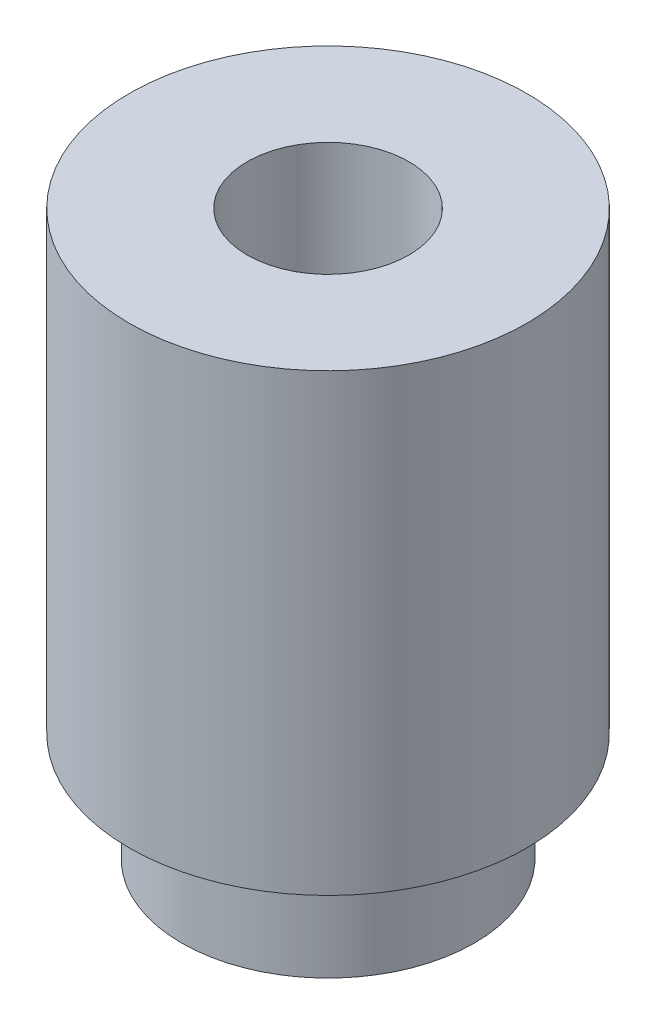
ISO-10303-21;
HEADER;
FILE_DESCRIPTION(('STEP AP214'),'2;1');
FILE_NAME('part.step','',(''),(''),'','','');
FILE_SCHEMA(('AUTOMOTIVE_DESIGN { 1 0 10303 214 1 1 1 1 }'));
ENDSEC;
DATA;
#1=APPLICATION_CONTEXT('core data for automotive mechanical design processes');
#2=APPLICATION_PROTOCOL_DEFINITION('international standard','automotive_design',2000,#1);
#3=PRODUCT_CONTEXT('',#1,'mechanical');
#4=PRODUCT('Part','Part','',(#3));
#5=PRODUCT_RELATED_PRODUCT_CATEGORY('part','',(#4));
#6=PRODUCT_DEFINITION_FORMATION('','',#4);
#7=PRODUCT_DEFINITION_CONTEXT('part definition',#1,'design');
#8=PRODUCT_DEFINITION('design','',#6,#7);
#9=PRODUCT_DEFINITION_SHAPE('','',#8);
#10=(LENGTH_UNIT() NAMED_UNIT(*) SI_UNIT(.MILLI.,.METRE.));
#11=(NAMED_UNIT(*) PLANE_ANGLE_UNIT() SI_UNIT($,.RADIAN.));
#12=(NAMED_UNIT(*) SI_UNIT($,.STERADIAN.) SOLID_ANGLE_UNIT());
#13=UNCERTAINTY_MEASURE_WITH_UNIT(LENGTH_MEASURE(1.E-05),#10,'distance_accuracy_value','');
#14=(GEOMETRIC_REPRESENTATION_CONTEXT(3) GLOBAL_UNCERTAINTY_ASSIGNED_CONTEXT((#13)) GLOBAL_UNIT_ASSIGNED_CONTEXT((#10,
#11,#12)) REPRESENTATION_CONTEXT('',''));
#15=CARTESIAN_POINT('',(0.,0.,0.));
#16=DIRECTION('',(0.,0.,1.));
#17=DIRECTION('',(1.,0.,0.));
#18=AXIS2_PLACEMENT_3D('',#15,#16,#17);
#19=CARTESIAN_POINT('',(0.,1.52,0.));
#20=DIRECTION('',(0.,-1.,0.));
#21=DIRECTION('',(0.,0.,-1.));
#22=AXIS2_PLACEMENT_3D('',#19,#20,#21);
#23=CYLINDRICAL_SURFACE('',#22,2.045);
#24=CARTESIAN_POINT('',(0.,1.52,0.));
#25=DIRECTION('',(0.,1.,0.));
#26=DIRECTION('',(0.,0.,1.));
#27=AXIS2_PLACEMENT_3D('',#24,#25,#26);
#28=CIRCLE('',#27,2.045);
#29=CARTESIAN_POINT('',(0.,1.52,2.045));
#30=VERTEX_POINT('',#29);
#31=EDGE_CURVE('E10',#30,#30,#28,.T.);
#32=ORIENTED_EDGE('',*,*,#31,.F.);
#33=EDGE_LOOP('',(#32));
#34=FACE_BOUND('',#33,.T.);
#35=CARTESIAN_POINT('',(0.,0.,0.));
#36=DIRECTION('',(0.,1.,0.));
#37=DIRECTION('',(0.,0.,1.));
#38=AXIS2_PLACEMENT_3D('',#35,#36,#37);
#39=CIRCLE('',#38,2.045);
#40=CARTESIAN_POINT('',(0.,0.,2.045));
#41=VERTEX_POINT('',#40);
#42=EDGE_CURVE('E45',#41,#41,#39,.T.);
#43=ORIENTED_EDGE('',*,*,#42,.T.);
#44=EDGE_LOOP('',(#43));
#45=FACE_BOUND('',#44,.T.);
#46=ADVANCED_FACE('F42',(#34,#45),#23,.T.);
#47=CARTESIAN_POINT('',(0.,0.,0.));
#48=DIRECTION('',(0.,1.,0.));
#49=DIRECTION('',(0.,0.,1.));
#50=AXIS2_PLACEMENT_3D('',#47,#48,#49);
#51=PLANE('',#50);
#52=CARTESIAN_POINT('',(0.,0.,0.));
#53=DIRECTION('',(0.,1.,0.));
#54=DIRECTION('',(0.,0.,1.));
#55=AXIS2_PLACEMENT_3D('',#52,#53,#54);
#56=CIRCLE('',#55,1.1303);
#57=CARTESIAN_POINT('',(0.,0.,1.1303));
#58=VERTEX_POINT('',#57);
#59=EDGE_CURVE('E60',#58,#58,#56,.T.);
#60=ORIENTED_EDGE('',*,*,#59,.T.);
#61=EDGE_LOOP('',(#60));
#62=FACE_BOUND('',#61,.T.);
#63=ORIENTED_EDGE('',*,*,#42,.F.);
#64=EDGE_LOOP('',(#63));
#65=FACE_BOUND('',#64,.T.);
#66=ADVANCED_FACE('F84',(#62,#65),#51,.F.);
#67=CARTESIAN_POINT('',(0.,7.87,0.));
#68=DIRECTION('',(0.,-1.,0.));
#69=DIRECTION('',(0.,0.,-1.));
#70=AXIS2_PLACEMENT_3D('',#67,#68,#69);
#71=CYLINDRICAL_SURFACE('',#70,2.78);
#72=CARTESIAN_POINT('',(0.,7.87,0.));
#73=DIRECTION('',(0.,1.,0.));
#74=DIRECTION('',(0.,0.,1.));
#75=AXIS2_PLACEMENT_3D('',#72,#73,#74);
#76=CIRCLE('',#75,2.78);
#77=CARTESIAN_POINT('',(0.,7.87,2.78));
#78=VERTEX_POINT('',#77);
#79=EDGE_CURVE('E54',#78,#78,#76,.T.);
#80=ORIENTED_EDGE('',*,*,#79,.F.);
#81=EDGE_LOOP('',(#80));
#82=FACE_BOUND('',#81,.T.);
#83=CARTESIAN_POINT('',(0.,1.52,0.));
#84=DIRECTION('',(0.,1.,0.));
#85=DIRECTION('',(0.,0.,1.));
#86=AXIS2_PLACEMENT_3D('',#83,#84,#85);
#87=CIRCLE('',#86,2.78);
#88=CARTESIAN_POINT('',(0.,1.52,2.78));
#89=VERTEX_POINT('',#88);
#90=EDGE_CURVE('E56',#89,#89,#87,.T.);
#91=ORIENTED_EDGE('',*,*,#90,.T.);
#92=EDGE_LOOP('',(#91));
#93=FACE_BOUND('',#92,.T.);
#94=ADVANCED_FACE('F78',(#82,#93),#71,.T.);
#95=CARTESIAN_POINT('',(0.,7.87,0.));
#96=DIRECTION('',(0.,1.,0.));
#97=DIRECTION('',(0.,0.,1.));
#98=AXIS2_PLACEMENT_3D('',#95,#96,#97);
#99=PLANE('',#98);
#100=CARTESIAN_POINT('',(0.,7.87,0.));
#101=DIRECTION('',(0.,1.,0.));
#102=DIRECTION('',(0.,0.,1.));
#103=AXIS2_PLACEMENT_3D('',#100,#101,#102);
#104=CIRCLE('',#103,1.1303);
#105=CARTESIAN_POINT('',(0.,7.87,1.1303));
#106=VERTEX_POINT('',#105);
#107=EDGE_CURVE('E67',#106,#106,#104,.T.);
#108=ORIENTED_EDGE('',*,*,#107,.F.);
#109=EDGE_LOOP('',(#108));
#110=FACE_BOUND('',#109,.T.);
#111=ORIENTED_EDGE('',*,*,#79,.T.);
#112=EDGE_LOOP('',(#111));
#113=FACE_BOUND('',#112,.T.);
#114=ADVANCED_FACE('F74',(#110,#113),#99,.T.);
#115=CARTESIAN_POINT('',(0.,1.52,0.));
#116=DIRECTION('',(0.,1.,0.));
#117=DIRECTION('',(0.,0.,1.));
#118=AXIS2_PLACEMENT_3D('',#115,#116,#117);
#119=PLANE('',#118);
#120=ORIENTED_EDGE('',*,*,#31,.T.);
#121=EDGE_LOOP('',(#120));
#122=FACE_BOUND('',#121,.T.);
#123=ORIENTED_EDGE('',*,*,#90,.F.);
#124=EDGE_LOOP('',(#123));
#125=FACE_BOUND('',#124,.T.);
#126=ADVANCED_FACE('F77',(#122,#125),#119,.F.);
#127=CARTESIAN_POINT('',(0.,7.87,0.));
#128=DIRECTION('',(0.,1.,0.));
#129=DIRECTION('',(0.,0.,1.));
#130=AXIS2_PLACEMENT_3D('',#127,#128,#129);
#131=CYLINDRICAL_SURFACE('',#130,1.1303);
#132=ORIENTED_EDGE('',*,*,#59,.F.);
#133=EDGE_LOOP('',(#132));
#134=FACE_BOUND('',#133,.T.);
#135=ORIENTED_EDGE('',*,*,#107,.T.);
#136=EDGE_LOOP('',(#135));
#137=FACE_BOUND('',#136,.T.);
#138=ADVANCED_FACE('F72',(#134,#137),#131,.F.);
#139=CLOSED_SHELL('',(#46,#66,#94,#114,#126,#138));
#140=MANIFOLD_SOLID_BREP('B2',#139);
#141=ADVANCED_BREP_SHAPE_REPRESENTATION('',(#18,#140),#14);
#142=SHAPE_DEFINITION_REPRESENTATION(#9,#141);
ENDSEC;
END-ISO-10303-21;
